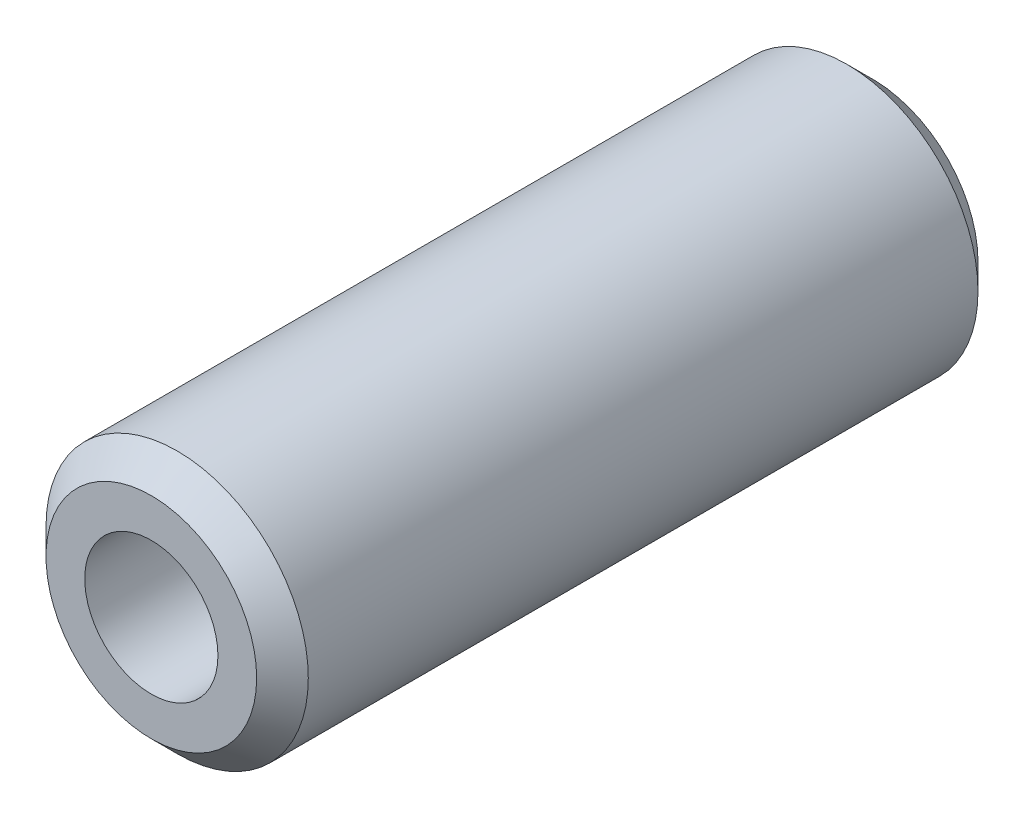
ISO-10303-21;
HEADER;
FILE_DESCRIPTION(('STEP AP214'),'2;1');
FILE_NAME('part.step','',(''),(''),'','','');
FILE_SCHEMA(('AUTOMOTIVE_DESIGN { 1 0 10303 214 1 1 1 1 }'));
ENDSEC;
DATA;
#1=APPLICATION_CONTEXT('core data for automotive mechanical design processes');
#2=APPLICATION_PROTOCOL_DEFINITION('international standard','automotive_design',2000,#1);
#3=PRODUCT_CONTEXT('',#1,'mechanical');
#4=PRODUCT('Part','Part','',(#3));
#5=PRODUCT_RELATED_PRODUCT_CATEGORY('part','',(#4));
#6=PRODUCT_DEFINITION_FORMATION('','',#4);
#7=PRODUCT_DEFINITION_CONTEXT('part definition',#1,'design');
#8=PRODUCT_DEFINITION('design','',#6,#7);
#9=PRODUCT_DEFINITION_SHAPE('','',#8);
#10=(LENGTH_UNIT() NAMED_UNIT(*) SI_UNIT(.MILLI.,.METRE.));
#11=(NAMED_UNIT(*) PLANE_ANGLE_UNIT() SI_UNIT($,.RADIAN.));
#12=(NAMED_UNIT(*) SI_UNIT($,.STERADIAN.) SOLID_ANGLE_UNIT());
#13=UNCERTAINTY_MEASURE_WITH_UNIT(LENGTH_MEASURE(1.E-05),#10,'distance_accuracy_value','');
#14=(GEOMETRIC_REPRESENTATION_CONTEXT(3) GLOBAL_UNCERTAINTY_ASSIGNED_CONTEXT((#13)) GLOBAL_UNIT_ASSIGNED_CONTEXT((#10,
#11,#12)) REPRESENTATION_CONTEXT('',''));
#15=CARTESIAN_POINT('',(0.,0.,0.));
#16=DIRECTION('',(0.,0.,1.));
#17=DIRECTION('',(1.,0.,0.));
#18=AXIS2_PLACEMENT_3D('',#15,#16,#17);
#19=CARTESIAN_POINT('',(0.,0.,69.85));
#20=DIRECTION('',(0.,0.,-1.));
#21=DIRECTION('',(-1.,0.,0.));
#22=AXIS2_PLACEMENT_3D('',#19,#20,#21);
#23=CYLINDRICAL_SURFACE('',#22,12.7);
#24=CARTESIAN_POINT('',(0.,0.,2.5));
#25=DIRECTION('',(0.,0.,1.));
#26=DIRECTION('',(1.,0.,0.));
#27=AXIS2_PLACEMENT_3D('',#24,#25,#26);
#28=CIRCLE('',#27,12.7);
#29=CARTESIAN_POINT('',(12.7,0.,2.5));
#30=VERTEX_POINT('',#29);
#31=EDGE_CURVE('E59',#30,#30,#28,.T.);
#32=ORIENTED_EDGE('',*,*,#31,.T.);
#33=EDGE_LOOP('',(#32));
#34=FACE_BOUND('',#33,.T.);
#35=CARTESIAN_POINT('',(0.,0.,67.35));
#36=DIRECTION('',(0.,0.,1.));
#37=DIRECTION('',(1.,0.,0.));
#38=AXIS2_PLACEMENT_3D('',#35,#36,#37);
#39=CIRCLE('',#38,12.7);
#40=CARTESIAN_POINT('',(12.7,0.,67.35));
#41=VERTEX_POINT('',#40);
#42=EDGE_CURVE('E64',#41,#41,#39,.F.);
#43=ORIENTED_EDGE('',*,*,#42,.T.);
#44=EDGE_LOOP('',(#43));
#45=FACE_BOUND('',#44,.T.);
#46=ADVANCED_FACE('F45',(#34,#45),#23,.T.);
#47=CARTESIAN_POINT('',(0.,0.,69.85));
#48=DIRECTION('',(0.,0.,1.));
#49=DIRECTION('',(1.,0.,0.));
#50=AXIS2_PLACEMENT_3D('',#47,#48,#49);
#51=PLANE('',#50);
#52=CARTESIAN_POINT('',(0.,0.,69.85));
#53=DIRECTION('',(0.,0.,1.));
#54=DIRECTION('',(1.,0.,0.));
#55=AXIS2_PLACEMENT_3D('',#52,#53,#54);
#56=CIRCLE('',#55,10.2);
#57=CARTESIAN_POINT('',(10.2,0.,69.85));
#58=VERTEX_POINT('',#57);
#59=EDGE_CURVE('E10',#58,#58,#56,.T.);
#60=ORIENTED_EDGE('',*,*,#59,.T.);
#61=EDGE_LOOP('',(#60));
#62=FACE_BOUND('',#61,.T.);
#63=CARTESIAN_POINT('',(0.,0.,69.85));
#64=DIRECTION('',(0.,0.,1.));
#65=DIRECTION('',(1.,0.,0.));
#66=AXIS2_PLACEMENT_3D('',#63,#64,#65);
#67=CIRCLE('',#66,6.45);
#68=CARTESIAN_POINT('',(6.45,0.,69.85));
#69=VERTEX_POINT('',#68);
#70=EDGE_CURVE('E71',#69,#69,#67,.T.);
#71=ORIENTED_EDGE('',*,*,#70,.F.);
#72=EDGE_LOOP('',(#71));
#73=FACE_BOUND('',#72,.T.);
#74=ADVANCED_FACE('F88',(#62,#73),#51,.T.);
#75=CARTESIAN_POINT('',(0.,0.,0.));
#76=DIRECTION('',(0.,0.,1.));
#77=DIRECTION('',(1.,0.,0.));
#78=AXIS2_PLACEMENT_3D('',#75,#76,#77);
#79=PLANE('',#78);
#80=CARTESIAN_POINT('',(0.,0.,0.));
#81=DIRECTION('',(0.,0.,1.));
#82=DIRECTION('',(1.,0.,0.));
#83=AXIS2_PLACEMENT_3D('',#80,#81,#82);
#84=CIRCLE('',#83,10.2);
#85=CARTESIAN_POINT('',(10.2,0.,0.));
#86=VERTEX_POINT('',#85);
#87=EDGE_CURVE('E54',#86,#86,#84,.F.);
#88=ORIENTED_EDGE('',*,*,#87,.T.);
#89=EDGE_LOOP('',(#88));
#90=FACE_BOUND('',#89,.T.);
#91=CARTESIAN_POINT('',(0.,0.,0.));
#92=DIRECTION('',(0.,0.,1.));
#93=DIRECTION('',(1.,0.,0.));
#94=AXIS2_PLACEMENT_3D('',#91,#92,#93);
#95=CIRCLE('',#94,6.45);
#96=CARTESIAN_POINT('',(6.45,0.,0.));
#97=VERTEX_POINT('',#96);
#98=EDGE_CURVE('E70',#97,#97,#95,.T.);
#99=ORIENTED_EDGE('',*,*,#98,.T.);
#100=EDGE_LOOP('',(#99));
#101=FACE_BOUND('',#100,.T.);
#102=ADVANCED_FACE('F79',(#90,#101),#79,.F.);
#103=CARTESIAN_POINT('',(0.,0.,0.));
#104=DIRECTION('',(0.,0.,1.));
#105=DIRECTION('',(1.,0.,0.));
#106=AXIS2_PLACEMENT_3D('',#103,#104,#105);
#107=CYLINDRICAL_SURFACE('',#106,6.45);
#108=ORIENTED_EDGE('',*,*,#98,.F.);
#109=EDGE_LOOP('',(#108));
#110=FACE_BOUND('',#109,.T.);
#111=ORIENTED_EDGE('',*,*,#70,.T.);
#112=EDGE_LOOP('',(#111));
#113=FACE_BOUND('',#112,.T.);
#114=ADVANCED_FACE('F81',(#110,#113),#107,.F.);
#115=CARTESIAN_POINT('',(0.,0.,2.5));
#116=DIRECTION('',(0.,0.,1.));
#117=DIRECTION('',(1.,0.,0.));
#118=AXIS2_PLACEMENT_3D('',#115,#116,#117);
#119=CONICAL_SURFACE('',#118,12.7,0.785398163397453);
#120=ORIENTED_EDGE('',*,*,#87,.F.);
#121=EDGE_LOOP('',(#120));
#122=FACE_BOUND('',#121,.T.);
#123=ORIENTED_EDGE('',*,*,#31,.F.);
#124=EDGE_LOOP('',(#123));
#125=FACE_BOUND('',#124,.T.);
#126=ADVANCED_FACE('F84',(#122,#125),#119,.T.);
#127=CARTESIAN_POINT('',(0.,0.,69.85));
#128=DIRECTION('',(0.,0.,-1.));
#129=DIRECTION('',(-1.,0.,0.));
#130=AXIS2_PLACEMENT_3D('',#127,#128,#129);
#131=CONICAL_SURFACE('',#130,10.2,0.785398163397448);
#132=ORIENTED_EDGE('',*,*,#42,.F.);
#133=EDGE_LOOP('',(#132));
#134=FACE_BOUND('',#133,.T.);
#135=ORIENTED_EDGE('',*,*,#59,.F.);
#136=EDGE_LOOP('',(#135));
#137=FACE_BOUND('',#136,.T.);
#138=ADVANCED_FACE('F48',(#134,#137),#131,.T.);
#139=CLOSED_SHELL('',(#46,#74,#102,#114,#126,#138));
#140=MANIFOLD_SOLID_BREP('B2',#139);
#141=ADVANCED_BREP_SHAPE_REPRESENTATION('',(#18,#140),#14);
#142=SHAPE_DEFINITION_REPRESENTATION(#9,#141);
ENDSEC;
END-ISO-10303-21;
